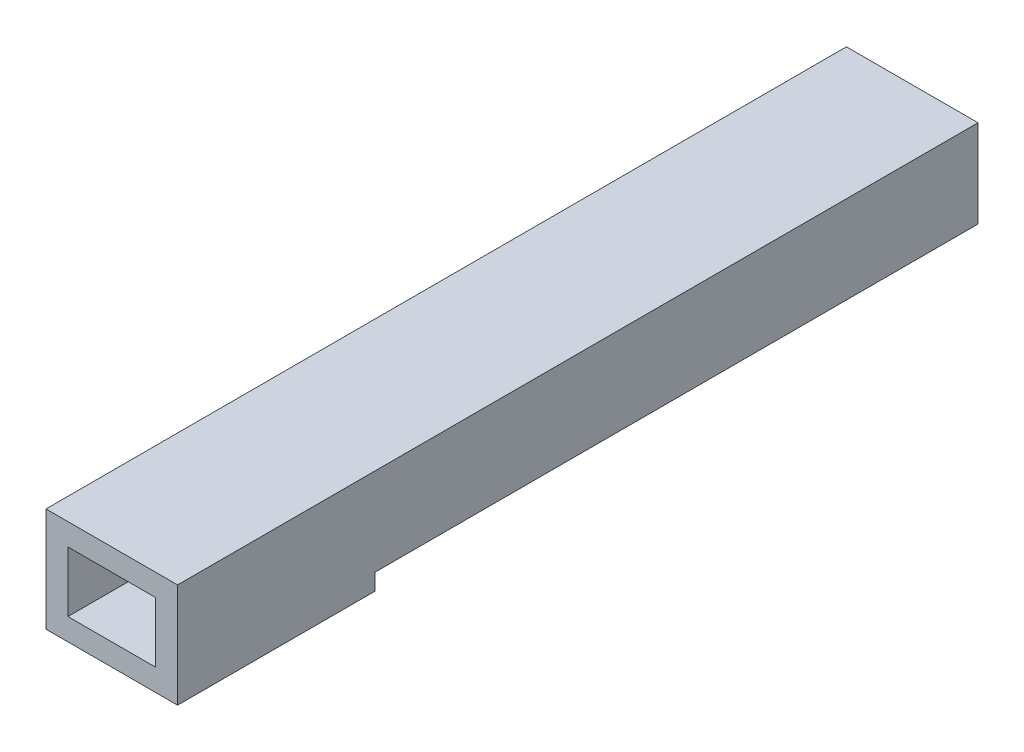
ISO-10303-21;
HEADER;
FILE_DESCRIPTION(('STEP AP214'),'2;1');
FILE_NAME('part.step','',(''),(''),'','','');
FILE_SCHEMA(('AUTOMOTIVE_DESIGN { 1 0 10303 214 1 1 1 1 }'));
ENDSEC;
DATA;
#1=APPLICATION_CONTEXT('core data for automotive mechanical design processes');
#2=APPLICATION_PROTOCOL_DEFINITION('international standard','automotive_design',2000,#1);
#3=PRODUCT_CONTEXT('',#1,'mechanical');
#4=PRODUCT('Part','Part','',(#3));
#5=PRODUCT_RELATED_PRODUCT_CATEGORY('part','',(#4));
#6=PRODUCT_DEFINITION_FORMATION('','',#4);
#7=PRODUCT_DEFINITION_CONTEXT('part definition',#1,'design');
#8=PRODUCT_DEFINITION('design','',#6,#7);
#9=PRODUCT_DEFINITION_SHAPE('','',#8);
#10=(LENGTH_UNIT() NAMED_UNIT(*) SI_UNIT(.MILLI.,.METRE.));
#11=(NAMED_UNIT(*) PLANE_ANGLE_UNIT() SI_UNIT($,.RADIAN.));
#12=(NAMED_UNIT(*) SI_UNIT($,.STERADIAN.) SOLID_ANGLE_UNIT());
#13=UNCERTAINTY_MEASURE_WITH_UNIT(LENGTH_MEASURE(1.E-05),#10,'distance_accuracy_value','');
#14=(GEOMETRIC_REPRESENTATION_CONTEXT(3) GLOBAL_UNCERTAINTY_ASSIGNED_CONTEXT((#13)) GLOBAL_UNIT_ASSIGNED_CONTEXT((#10,
#11,#12)) REPRESENTATION_CONTEXT('',''));
#15=CARTESIAN_POINT('',(0.,0.,0.));
#16=DIRECTION('',(0.,0.,1.));
#17=DIRECTION('',(1.,0.,0.));
#18=AXIS2_PLACEMENT_3D('',#15,#16,#17);
#19=CARTESIAN_POINT('',(-60.,165.,-574.));
#20=DIRECTION('',(-1.,0.,0.));
#21=DIRECTION('',(0.,0.,1.));
#22=AXIS2_PLACEMENT_3D('',#19,#20,#21);
#23=PLANE('',#22);
#24=DIRECTION('',(0.,0.,-1.));
#25=VECTOR('',#24,1.);
#26=CARTESIAN_POINT('',(-60.,180.,-23.9999999999999));
#27=LINE('',#26,#25);
#28=CARTESIAN_POINT('',(-60.,180.,-23.9999999999999));
#29=VERTEX_POINT('',#28);
#30=CARTESIAN_POINT('',(-60.,180.,-574.));
#31=VERTEX_POINT('',#30);
#32=EDGE_CURVE('E210',#29,#31,#27,.T.);
#33=ORIENTED_EDGE('',*,*,#32,.F.);
#34=DIRECTION('',(0.,1.,0.));
#35=VECTOR('',#34,1.);
#36=CARTESIAN_POINT('',(-60.,180.,-23.9999999999999));
#37=LINE('',#36,#35);
#38=CARTESIAN_POINT('',(-60.,165.,-23.9999999999999));
#39=VERTEX_POINT('',#38);
#40=EDGE_CURVE('E198',#39,#29,#37,.T.);
#41=ORIENTED_EDGE('',*,*,#40,.F.);
#42=DIRECTION('',(0.,0.,1.));
#43=VECTOR('',#42,1.);
#44=CARTESIAN_POINT('',(-60.,165.,-574.));
#45=LINE('',#44,#43);
#46=CARTESIAN_POINT('',(-60.,165.,156.));
#47=VERTEX_POINT('',#46);
#48=EDGE_CURVE('E38',#39,#47,#45,.T.);
#49=ORIENTED_EDGE('',*,*,#48,.T.);
#50=DIRECTION('',(0.,1.,0.));
#51=VECTOR('',#50,1.);
#52=CARTESIAN_POINT('',(-60.,165.,156.));
#53=LINE('',#52,#51);
#54=CARTESIAN_POINT('',(-60.,260.,156.));
#55=VERTEX_POINT('',#54);
#56=EDGE_CURVE('E233',#47,#55,#53,.T.);
#57=ORIENTED_EDGE('',*,*,#56,.T.);
#58=DIRECTION('',(0.,0.,1.));
#59=VECTOR('',#58,1.);
#60=CARTESIAN_POINT('',(-60.,260.,-574.));
#61=LINE('',#60,#59);
#62=CARTESIAN_POINT('',(-60.,260.,-574.));
#63=VERTEX_POINT('',#62);
#64=EDGE_CURVE('E11',#63,#55,#61,.T.);
#65=ORIENTED_EDGE('',*,*,#64,.F.);
#66=DIRECTION('',(0.,-1.,0.));
#67=VECTOR('',#66,1.);
#68=CARTESIAN_POINT('',(-60.,165.,-574.));
#69=LINE('',#68,#67);
#70=EDGE_CURVE('E276',#63,#31,#69,.T.);
#71=ORIENTED_EDGE('',*,*,#70,.T.);
#72=EDGE_LOOP('',(#33,#41,#49,#57,#65,#71));
#73=FACE_BOUND('',#72,.T.);
#74=ADVANCED_FACE('F35',(#73),#23,.T.);
#75=CARTESIAN_POINT('',(-60.,260.,-574.));
#76=DIRECTION('',(0.,1.,0.));
#77=DIRECTION('',(0.,0.,1.));
#78=AXIS2_PLACEMENT_3D('',#75,#76,#77);
#79=PLANE('',#78);
#80=ORIENTED_EDGE('',*,*,#64,.T.);
#81=DIRECTION('',(1.,0.,0.));
#82=VECTOR('',#81,1.);
#83=CARTESIAN_POINT('',(-60.,260.,156.));
#84=LINE('',#83,#82);
#85=CARTESIAN_POINT('',(60.,260.,156.));
#86=VERTEX_POINT('',#85);
#87=EDGE_CURVE('E251',#55,#86,#84,.T.);
#88=ORIENTED_EDGE('',*,*,#87,.T.);
#89=DIRECTION('',(0.,0.,1.));
#90=VECTOR('',#89,1.);
#91=CARTESIAN_POINT('',(60.,260.,-574.));
#92=LINE('',#91,#90);
#93=CARTESIAN_POINT('',(60.,260.,-574.));
#94=VERTEX_POINT('',#93);
#95=EDGE_CURVE('E43',#94,#86,#92,.T.);
#96=ORIENTED_EDGE('',*,*,#95,.F.);
#97=DIRECTION('',(-1.,0.,0.));
#98=VECTOR('',#97,1.);
#99=CARTESIAN_POINT('',(-60.,260.,-574.));
#100=LINE('',#99,#98);
#101=EDGE_CURVE('E288',#94,#63,#100,.T.);
#102=ORIENTED_EDGE('',*,*,#101,.T.);
#103=EDGE_LOOP('',(#80,#88,#96,#102));
#104=FACE_BOUND('',#103,.T.);
#105=ADVANCED_FACE('F316',(#104),#79,.T.);
#106=CARTESIAN_POINT('',(60.,165.,-574.));
#107=DIRECTION('',(1.,0.,0.));
#108=DIRECTION('',(0.,0.,-1.));
#109=AXIS2_PLACEMENT_3D('',#106,#107,#108);
#110=PLANE('',#109);
#111=DIRECTION('',(0.,0.,-1.));
#112=VECTOR('',#111,1.);
#113=CARTESIAN_POINT('',(60.,180.,-23.9999999999999));
#114=LINE('',#113,#112);
#115=CARTESIAN_POINT('',(60.,180.,-23.9999999999999));
#116=VERTEX_POINT('',#115);
#117=CARTESIAN_POINT('',(60.,180.,-574.));
#118=VERTEX_POINT('',#117);
#119=EDGE_CURVE('E230',#116,#118,#114,.T.);
#120=ORIENTED_EDGE('',*,*,#119,.T.);
#121=DIRECTION('',(0.,1.,0.));
#122=VECTOR('',#121,1.);
#123=CARTESIAN_POINT('',(60.,165.,-574.));
#124=LINE('',#123,#122);
#125=EDGE_CURVE('E286',#118,#94,#124,.T.);
#126=ORIENTED_EDGE('',*,*,#125,.T.);
#127=ORIENTED_EDGE('',*,*,#95,.T.);
#128=DIRECTION('',(0.,-1.,0.));
#129=VECTOR('',#128,1.);
#130=CARTESIAN_POINT('',(60.,165.,156.));
#131=LINE('',#130,#129);
#132=CARTESIAN_POINT('',(60.,165.,156.));
#133=VERTEX_POINT('',#132);
#134=EDGE_CURVE('E248',#86,#133,#131,.T.);
#135=ORIENTED_EDGE('',*,*,#134,.T.);
#136=DIRECTION('',(0.,0.,1.));
#137=VECTOR('',#136,1.);
#138=CARTESIAN_POINT('',(60.,165.,-574.));
#139=LINE('',#138,#137);
#140=CARTESIAN_POINT('',(60.,165.,-23.9999999999999));
#141=VERTEX_POINT('',#140);
#142=EDGE_CURVE('E291',#141,#133,#139,.T.);
#143=ORIENTED_EDGE('',*,*,#142,.F.);
#144=DIRECTION('',(0.,-1.,0.));
#145=VECTOR('',#144,1.);
#146=CARTESIAN_POINT('',(60.,180.,-23.9999999999999));
#147=LINE('',#146,#145);
#148=EDGE_CURVE('E224',#116,#141,#147,.T.);
#149=ORIENTED_EDGE('',*,*,#148,.F.);
#150=EDGE_LOOP('',(#120,#126,#127,#135,#143,#149));
#151=FACE_BOUND('',#150,.T.);
#152=ADVANCED_FACE('F308',(#151),#110,.T.);
#153=CARTESIAN_POINT('',(-60.,165.,-574.));
#154=DIRECTION('',(0.,-1.,0.));
#155=DIRECTION('',(0.,0.,-1.));
#156=AXIS2_PLACEMENT_3D('',#153,#154,#155);
#157=PLANE('',#156);
#158=CARTESIAN_POINT('',(0.,165.,-495.413950444321));
#159=DIRECTION('',(0.,-1.,0.));
#160=DIRECTION('',(0.,0.,-1.));
#161=AXIS2_PLACEMENT_3D('',#158,#159,#160);
#162=CIRCLE('',#161,15.6403522426933);
#163=CARTESIAN_POINT('',(-15.6403522426933,165.,-495.413950444321));
#164=VERTEX_POINT('',#163);
#165=CARTESIAN_POINT('',(15.6403522426933,165.,-495.413950444321));
#166=VERTEX_POINT('',#165);
#167=EDGE_CURVE('E51',#164,#166,#162,.T.);
#168=ORIENTED_EDGE('',*,*,#167,.F.);
#169=DIRECTION('',(0.,0.,-1.));
#170=VECTOR('',#169,1.);
#171=CARTESIAN_POINT('',(-15.6403522426933,165.,-495.413950444321));
#172=LINE('',#171,#170);
#173=CARTESIAN_POINT('',(-15.6403522426933,165.,-159.146377226416));
#174=VERTEX_POINT('',#173);
#175=EDGE_CURVE('E179',#174,#164,#172,.T.);
#176=ORIENTED_EDGE('',*,*,#175,.F.);
#177=CARTESIAN_POINT('',(0.,165.,-159.146377226416));
#178=DIRECTION('',(0.,-1.,0.));
#179=DIRECTION('',(0.,0.,-1.));
#180=AXIS2_PLACEMENT_3D('',#177,#178,#179);
#181=CIRCLE('',#180,15.6403522426933);
#182=CARTESIAN_POINT('',(15.6403522426933,165.,-159.146377226416));
#183=VERTEX_POINT('',#182);
#184=EDGE_CURVE('E163',#183,#174,#181,.T.);
#185=ORIENTED_EDGE('',*,*,#184,.F.);
#186=DIRECTION('',(0.,0.,1.));
#187=VECTOR('',#186,1.);
#188=CARTESIAN_POINT('',(15.6403522426933,165.,-495.413950444321));
#189=LINE('',#188,#187);
#190=EDGE_CURVE('E172',#166,#183,#189,.T.);
#191=ORIENTED_EDGE('',*,*,#190,.F.);
#192=EDGE_LOOP('',(#168,#176,#185,#191));
#193=FACE_BOUND('',#192,.T.);
#194=DIRECTION('',(0.,0.,-1.));
#195=VECTOR('',#194,1.);
#196=CARTESIAN_POINT('',(-40.,165.,-23.9999999999999));
#197=LINE('',#196,#195);
#198=CARTESIAN_POINT('',(-40.,165.,-23.9999999999999));
#199=VERTEX_POINT('',#198);
#200=CARTESIAN_POINT('',(-40.,165.,-574.));
#201=VERTEX_POINT('',#200);
#202=EDGE_CURVE('E203',#199,#201,#197,.T.);
#203=ORIENTED_EDGE('',*,*,#202,.T.);
#204=DIRECTION('',(1.,0.,0.));
#205=VECTOR('',#204,1.);
#206=CARTESIAN_POINT('',(-60.,165.,-574.));
#207=LINE('',#206,#205);
#208=CARTESIAN_POINT('',(40.,165.,-574.));
#209=VERTEX_POINT('',#208);
#210=EDGE_CURVE('E284',#201,#209,#207,.T.);
#211=ORIENTED_EDGE('',*,*,#210,.T.);
#212=DIRECTION('',(0.,0.,-1.));
#213=VECTOR('',#212,1.);
#214=CARTESIAN_POINT('',(40.,165.,-23.9999999999999));
#215=LINE('',#214,#213);
#216=CARTESIAN_POINT('',(40.,165.,-23.9999999999999));
#217=VERTEX_POINT('',#216);
#218=EDGE_CURVE('E226',#217,#209,#215,.T.);
#219=ORIENTED_EDGE('',*,*,#218,.F.);
#220=DIRECTION('',(-1.,0.,0.));
#221=VECTOR('',#220,1.);
#222=CARTESIAN_POINT('',(60.,165.,-23.9999999999999));
#223=LINE('',#222,#221);
#224=EDGE_CURVE('E214',#141,#217,#223,.T.);
#225=ORIENTED_EDGE('',*,*,#224,.F.);
#226=ORIENTED_EDGE('',*,*,#142,.T.);
#227=DIRECTION('',(-1.,0.,0.));
#228=VECTOR('',#227,1.);
#229=CARTESIAN_POINT('',(-60.,165.,156.));
#230=LINE('',#229,#228);
#231=EDGE_CURVE('E245',#133,#47,#230,.T.);
#232=ORIENTED_EDGE('',*,*,#231,.T.);
#233=ORIENTED_EDGE('',*,*,#48,.F.);
#234=DIRECTION('',(-1.,0.,0.));
#235=VECTOR('',#234,1.);
#236=CARTESIAN_POINT('',(-60.,165.,-23.9999999999999));
#237=LINE('',#236,#235);
#238=EDGE_CURVE('E195',#199,#39,#237,.T.);
#239=ORIENTED_EDGE('',*,*,#238,.F.);
#240=EDGE_LOOP('',(#203,#211,#219,#225,#226,#232,#233,#239));
#241=FACE_BOUND('',#240,.T.);
#242=ADVANCED_FACE('F176',(#193,#241),#157,.T.);
#243=CARTESIAN_POINT('',(0.,0.,-574.));
#244=DIRECTION('',(0.,0.,-1.));
#245=DIRECTION('',(-1.,0.,0.));
#246=AXIS2_PLACEMENT_3D('',#243,#244,#245);
#247=PLANE('',#246);
#248=DIRECTION('',(-0.55470019622523,-0.832050294337843,0.));
#249=VECTOR('',#248,1.);
#250=CARTESIAN_POINT('',(-40.,165.,-574.));
#251=LINE('',#250,#249);
#252=CARTESIAN_POINT('',(-30.,180.,-574.));
#253=VERTEX_POINT('',#252);
#254=EDGE_CURVE('E190',#253,#201,#251,.T.);
#255=ORIENTED_EDGE('',*,*,#254,.F.);
#256=DIRECTION('',(1.,0.,0.));
#257=VECTOR('',#256,1.);
#258=CARTESIAN_POINT('',(-30.,180.,-574.));
#259=LINE('',#258,#257);
#260=EDGE_CURVE('E196',#31,#253,#259,.T.);
#261=ORIENTED_EDGE('',*,*,#260,.F.);
#262=ORIENTED_EDGE('',*,*,#70,.F.);
#263=ORIENTED_EDGE('',*,*,#101,.F.);
#264=ORIENTED_EDGE('',*,*,#125,.F.);
#265=DIRECTION('',(1.,0.,0.));
#266=VECTOR('',#265,1.);
#267=CARTESIAN_POINT('',(30.,180.,-574.));
#268=LINE('',#267,#266);
#269=CARTESIAN_POINT('',(30.,180.,-574.));
#270=VERTEX_POINT('',#269);
#271=EDGE_CURVE('E218',#270,#118,#268,.T.);
#272=ORIENTED_EDGE('',*,*,#271,.F.);
#273=DIRECTION('',(-0.55470019622523,0.832050294337843,0.));
#274=VECTOR('',#273,1.);
#275=CARTESIAN_POINT('',(40.,165.,-574.));
#276=LINE('',#275,#274);
#277=EDGE_CURVE('E209',#209,#270,#276,.T.);
#278=ORIENTED_EDGE('',*,*,#277,.F.);
#279=ORIENTED_EDGE('',*,*,#210,.F.);
#280=EDGE_LOOP('',(#255,#261,#262,#263,#264,#272,#278,#279));
#281=FACE_BOUND('',#280,.T.);
#282=DIRECTION('',(0.,-1.,0.));
#283=VECTOR('',#282,1.);
#284=CARTESIAN_POINT('',(-40.,185.,-574.));
#285=LINE('',#284,#283);
#286=CARTESIAN_POINT('',(-40.,240.,-574.));
#287=VERTEX_POINT('',#286);
#288=CARTESIAN_POINT('',(-40.,185.,-574.));
#289=VERTEX_POINT('',#288);
#290=EDGE_CURVE('E259',#287,#289,#285,.T.);
#291=ORIENTED_EDGE('',*,*,#290,.T.);
#292=DIRECTION('',(1.,0.,0.));
#293=VECTOR('',#292,1.);
#294=CARTESIAN_POINT('',(-40.,185.,-574.));
#295=LINE('',#294,#293);
#296=CARTESIAN_POINT('',(40.,185.,-574.));
#297=VERTEX_POINT('',#296);
#298=EDGE_CURVE('E264',#289,#297,#295,.T.);
#299=ORIENTED_EDGE('',*,*,#298,.T.);
#300=DIRECTION('',(0.,1.,0.));
#301=VECTOR('',#300,1.);
#302=CARTESIAN_POINT('',(40.,185.,-574.));
#303=LINE('',#302,#301);
#304=CARTESIAN_POINT('',(40.,240.,-574.));
#305=VERTEX_POINT('',#304);
#306=EDGE_CURVE('E267',#297,#305,#303,.T.);
#307=ORIENTED_EDGE('',*,*,#306,.T.);
#308=DIRECTION('',(-1.,0.,0.));
#309=VECTOR('',#308,1.);
#310=CARTESIAN_POINT('',(-40.,240.,-574.));
#311=LINE('',#310,#309);
#312=EDGE_CURVE('E270',#305,#287,#311,.T.);
#313=ORIENTED_EDGE('',*,*,#312,.T.);
#314=EDGE_LOOP('',(#291,#299,#307,#313));
#315=FACE_BOUND('',#314,.T.);
#316=ADVANCED_FACE('F307',(#281,#315),#247,.T.);
#317=CARTESIAN_POINT('',(-40.,185.,-574.));
#318=DIRECTION('',(-1.,0.,0.));
#319=DIRECTION('',(0.,0.,1.));
#320=AXIS2_PLACEMENT_3D('',#317,#318,#319);
#321=PLANE('',#320);
#322=DIRECTION('',(0.,0.,1.));
#323=VECTOR('',#322,1.);
#324=CARTESIAN_POINT('',(-40.,240.,-574.));
#325=LINE('',#324,#323);
#326=CARTESIAN_POINT('',(-40.,240.,156.));
#327=VERTEX_POINT('',#326);
#328=EDGE_CURVE('E274',#287,#327,#325,.T.);
#329=ORIENTED_EDGE('',*,*,#328,.T.);
#330=DIRECTION('',(0.,1.,0.));
#331=VECTOR('',#330,1.);
#332=CARTESIAN_POINT('',(-40.,185.,156.));
#333=LINE('',#332,#331);
#334=CARTESIAN_POINT('',(-40.,185.,156.));
#335=VERTEX_POINT('',#334);
#336=EDGE_CURVE('E242',#335,#327,#333,.T.);
#337=ORIENTED_EDGE('',*,*,#336,.F.);
#338=DIRECTION('',(0.,0.,1.));
#339=VECTOR('',#338,1.);
#340=CARTESIAN_POINT('',(-40.,185.,-574.));
#341=LINE('',#340,#339);
#342=EDGE_CURVE('E273',#289,#335,#341,.T.);
#343=ORIENTED_EDGE('',*,*,#342,.F.);
#344=ORIENTED_EDGE('',*,*,#290,.F.);
#345=EDGE_LOOP('',(#329,#337,#343,#344));
#346=FACE_BOUND('',#345,.T.);
#347=ADVANCED_FACE('F313',(#346),#321,.F.);
#348=CARTESIAN_POINT('',(-40.,240.,-574.));
#349=DIRECTION('',(0.,1.,0.));
#350=DIRECTION('',(0.,0.,1.));
#351=AXIS2_PLACEMENT_3D('',#348,#349,#350);
#352=PLANE('',#351);
#353=DIRECTION('',(0.,0.,1.));
#354=VECTOR('',#353,1.);
#355=CARTESIAN_POINT('',(40.,240.,-574.));
#356=LINE('',#355,#354);
#357=CARTESIAN_POINT('',(40.,240.,156.));
#358=VERTEX_POINT('',#357);
#359=EDGE_CURVE('E277',#305,#358,#356,.T.);
#360=ORIENTED_EDGE('',*,*,#359,.T.);
#361=DIRECTION('',(1.,0.,0.));
#362=VECTOR('',#361,1.);
#363=CARTESIAN_POINT('',(-40.,240.,156.));
#364=LINE('',#363,#362);
#365=EDGE_CURVE('E238',#327,#358,#364,.T.);
#366=ORIENTED_EDGE('',*,*,#365,.F.);
#367=ORIENTED_EDGE('',*,*,#328,.F.);
#368=ORIENTED_EDGE('',*,*,#312,.F.);
#369=EDGE_LOOP('',(#360,#366,#367,#368));
#370=FACE_BOUND('',#369,.T.);
#371=ADVANCED_FACE('F330',(#370),#352,.F.);
#372=CARTESIAN_POINT('',(40.,185.,-574.));
#373=DIRECTION('',(1.,0.,0.));
#374=DIRECTION('',(0.,0.,-1.));
#375=AXIS2_PLACEMENT_3D('',#372,#373,#374);
#376=PLANE('',#375);
#377=DIRECTION('',(0.,0.,1.));
#378=VECTOR('',#377,1.);
#379=CARTESIAN_POINT('',(40.,185.,-574.));
#380=LINE('',#379,#378);
#381=CARTESIAN_POINT('',(40.,185.,156.));
#382=VERTEX_POINT('',#381);
#383=EDGE_CURVE('E279',#297,#382,#380,.T.);
#384=ORIENTED_EDGE('',*,*,#383,.T.);
#385=DIRECTION('',(0.,-1.,0.));
#386=VECTOR('',#385,1.);
#387=CARTESIAN_POINT('',(40.,185.,156.));
#388=LINE('',#387,#386);
#389=EDGE_CURVE('E241',#358,#382,#388,.T.);
#390=ORIENTED_EDGE('',*,*,#389,.F.);
#391=ORIENTED_EDGE('',*,*,#359,.F.);
#392=ORIENTED_EDGE('',*,*,#306,.F.);
#393=EDGE_LOOP('',(#384,#390,#391,#392));
#394=FACE_BOUND('',#393,.T.);
#395=ADVANCED_FACE('F335',(#394),#376,.F.);
#396=CARTESIAN_POINT('',(-40.,185.,-574.));
#397=DIRECTION('',(0.,-1.,0.));
#398=DIRECTION('',(0.,0.,-1.));
#399=AXIS2_PLACEMENT_3D('',#396,#397,#398);
#400=PLANE('',#399);
#401=DIRECTION('',(0.,0.,1.));
#402=VECTOR('',#401,1.);
#403=CARTESIAN_POINT('',(-15.6403522426933,185.,-495.413950444321));
#404=LINE('',#403,#402);
#405=CARTESIAN_POINT('',(-15.6403522426933,185.,-495.413950444321));
#406=VERTEX_POINT('',#405);
#407=CARTESIAN_POINT('',(-15.6403522426933,185.,-159.146377226416));
#408=VERTEX_POINT('',#407);
#409=EDGE_CURVE('E384',#406,#408,#404,.T.);
#410=ORIENTED_EDGE('',*,*,#409,.F.);
#411=CARTESIAN_POINT('',(0.,185.,-495.413950444321));
#412=DIRECTION('',(0.,-1.,0.));
#413=DIRECTION('',(0.,0.,-1.));
#414=AXIS2_PLACEMENT_3D('',#411,#412,#413);
#415=CIRCLE('',#414,15.6403522426933);
#416=CARTESIAN_POINT('',(15.6403522426933,185.,-495.413950444321));
#417=VERTEX_POINT('',#416);
#418=EDGE_CURVE('E191',#417,#406,#415,.F.);
#419=ORIENTED_EDGE('',*,*,#418,.F.);
#420=DIRECTION('',(0.,0.,-1.));
#421=VECTOR('',#420,1.);
#422=CARTESIAN_POINT('',(15.6403522426933,185.,-495.413950444321));
#423=LINE('',#422,#421);
#424=CARTESIAN_POINT('',(15.6403522426933,185.,-159.146377226416));
#425=VERTEX_POINT('',#424);
#426=EDGE_CURVE('E188',#425,#417,#423,.T.);
#427=ORIENTED_EDGE('',*,*,#426,.F.);
#428=CARTESIAN_POINT('',(0.,185.,-159.146377226416));
#429=DIRECTION('',(0.,-1.,0.));
#430=DIRECTION('',(0.,0.,-1.));
#431=AXIS2_PLACEMENT_3D('',#428,#429,#430);
#432=CIRCLE('',#431,15.6403522426933);
#433=EDGE_CURVE('E166',#408,#425,#432,.F.);
#434=ORIENTED_EDGE('',*,*,#433,.F.);
#435=EDGE_LOOP('',(#410,#419,#427,#434));
#436=FACE_BOUND('',#435,.T.);
#437=ORIENTED_EDGE('',*,*,#342,.T.);
#438=DIRECTION('',(-1.,0.,0.));
#439=VECTOR('',#438,1.);
#440=CARTESIAN_POINT('',(-40.,185.,156.));
#441=LINE('',#440,#439);
#442=EDGE_CURVE('E256',#382,#335,#441,.T.);
#443=ORIENTED_EDGE('',*,*,#442,.F.);
#444=ORIENTED_EDGE('',*,*,#383,.F.);
#445=ORIENTED_EDGE('',*,*,#298,.F.);
#446=EDGE_LOOP('',(#437,#443,#444,#445));
#447=FACE_BOUND('',#446,.T.);
#448=ADVANCED_FACE('F332',(#436,#447),#400,.F.);
#449=CARTESIAN_POINT('',(-137.5,165.,156.));
#450=DIRECTION('',(0.,0.,-1.));
#451=DIRECTION('',(-1.,0.,0.));
#452=AXIS2_PLACEMENT_3D('',#449,#450,#451);
#453=PLANE('',#452);
#454=ORIENTED_EDGE('',*,*,#336,.T.);
#455=ORIENTED_EDGE('',*,*,#365,.T.);
#456=ORIENTED_EDGE('',*,*,#389,.T.);
#457=ORIENTED_EDGE('',*,*,#442,.T.);
#458=EDGE_LOOP('',(#454,#455,#456,#457));
#459=FACE_BOUND('',#458,.T.);
#460=ORIENTED_EDGE('',*,*,#231,.F.);
#461=ORIENTED_EDGE('',*,*,#134,.F.);
#462=ORIENTED_EDGE('',*,*,#87,.F.);
#463=ORIENTED_EDGE('',*,*,#56,.F.);
#464=EDGE_LOOP('',(#460,#461,#462,#463));
#465=FACE_BOUND('',#464,.T.);
#466=ADVANCED_FACE('F303',(#459,#465),#453,.F.);
#467=CARTESIAN_POINT('',(30.,180.,-23.9999999999999));
#468=DIRECTION('',(0.,1.,0.));
#469=DIRECTION('',(0.,0.,1.));
#470=AXIS2_PLACEMENT_3D('',#467,#468,#469);
#471=PLANE('',#470);
#472=ORIENTED_EDGE('',*,*,#271,.T.);
#473=ORIENTED_EDGE('',*,*,#119,.F.);
#474=DIRECTION('',(1.,0.,0.));
#475=VECTOR('',#474,1.);
#476=CARTESIAN_POINT('',(30.,180.,-23.9999999999999));
#477=LINE('',#476,#475);
#478=CARTESIAN_POINT('',(30.,180.,-23.9999999999999));
#479=VERTEX_POINT('',#478);
#480=EDGE_CURVE('E221',#479,#116,#477,.T.);
#481=ORIENTED_EDGE('',*,*,#480,.F.);
#482=DIRECTION('',(0.,0.,-1.));
#483=VECTOR('',#482,1.);
#484=CARTESIAN_POINT('',(30.,180.,-23.9999999999999));
#485=LINE('',#484,#483);
#486=EDGE_CURVE('E234',#479,#270,#485,.T.);
#487=ORIENTED_EDGE('',*,*,#486,.T.);
#488=EDGE_LOOP('',(#472,#473,#481,#487));
#489=FACE_BOUND('',#488,.T.);
#490=ADVANCED_FACE('F345',(#489),#471,.F.);
#491=CARTESIAN_POINT('',(40.,165.,-23.9999999999999));
#492=DIRECTION('',(-0.832050294337843,-0.55470019622523,0.));
#493=DIRECTION('',(0.55470019622523,-0.832050294337843,0.));
#494=AXIS2_PLACEMENT_3D('',#491,#492,#493);
#495=PLANE('',#494);
#496=ORIENTED_EDGE('',*,*,#277,.T.);
#497=ORIENTED_EDGE('',*,*,#486,.F.);
#498=DIRECTION('',(-0.55470019622523,0.832050294337843,0.));
#499=VECTOR('',#498,1.);
#500=CARTESIAN_POINT('',(40.,165.,-23.9999999999999));
#501=LINE('',#500,#499);
#502=EDGE_CURVE('E217',#217,#479,#501,.T.);
#503=ORIENTED_EDGE('',*,*,#502,.F.);
#504=ORIENTED_EDGE('',*,*,#218,.T.);
#505=EDGE_LOOP('',(#496,#497,#503,#504));
#506=FACE_BOUND('',#505,.T.);
#507=ADVANCED_FACE('F347',(#506),#495,.F.);
#508=CARTESIAN_POINT('',(0.,0.,-23.9999999999999));
#509=DIRECTION('',(0.,0.,1.));
#510=DIRECTION('',(1.,0.,0.));
#511=AXIS2_PLACEMENT_3D('',#508,#509,#510);
#512=PLANE('',#511);
#513=ORIENTED_EDGE('',*,*,#224,.T.);
#514=ORIENTED_EDGE('',*,*,#502,.T.);
#515=ORIENTED_EDGE('',*,*,#480,.T.);
#516=ORIENTED_EDGE('',*,*,#148,.T.);
#517=EDGE_LOOP('',(#513,#514,#515,#516));
#518=FACE_BOUND('',#517,.T.);
#519=ADVANCED_FACE('F350',(#518),#512,.F.);
#520=CARTESIAN_POINT('',(-40.,165.,-23.9999999999999));
#521=DIRECTION('',(0.832050294337843,-0.55470019622523,0.));
#522=DIRECTION('',(0.55470019622523,0.832050294337843,0.));
#523=AXIS2_PLACEMENT_3D('',#520,#521,#522);
#524=PLANE('',#523);
#525=ORIENTED_EDGE('',*,*,#254,.T.);
#526=ORIENTED_EDGE('',*,*,#202,.F.);
#527=DIRECTION('',(-0.55470019622523,-0.832050294337843,0.));
#528=VECTOR('',#527,1.);
#529=CARTESIAN_POINT('',(-40.,165.,-23.9999999999999));
#530=LINE('',#529,#528);
#531=CARTESIAN_POINT('',(-30.,180.,-23.9999999999999));
#532=VERTEX_POINT('',#531);
#533=EDGE_CURVE('E192',#532,#199,#530,.T.);
#534=ORIENTED_EDGE('',*,*,#533,.F.);
#535=DIRECTION('',(0.,0.,-1.));
#536=VECTOR('',#535,1.);
#537=CARTESIAN_POINT('',(-30.,180.,-23.9999999999999));
#538=LINE('',#537,#536);
#539=EDGE_CURVE('E207',#532,#253,#538,.T.);
#540=ORIENTED_EDGE('',*,*,#539,.T.);
#541=EDGE_LOOP('',(#525,#526,#534,#540));
#542=FACE_BOUND('',#541,.T.);
#543=ADVANCED_FACE('F357',(#542),#524,.F.);
#544=CARTESIAN_POINT('',(-30.,180.,-23.9999999999999));
#545=DIRECTION('',(0.,1.,0.));
#546=DIRECTION('',(0.,0.,1.));
#547=AXIS2_PLACEMENT_3D('',#544,#545,#546);
#548=PLANE('',#547);
#549=ORIENTED_EDGE('',*,*,#260,.T.);
#550=ORIENTED_EDGE('',*,*,#539,.F.);
#551=DIRECTION('',(1.,0.,0.));
#552=VECTOR('',#551,1.);
#553=CARTESIAN_POINT('',(-30.,180.,-23.9999999999999));
#554=LINE('',#553,#552);
#555=EDGE_CURVE('E200',#29,#532,#554,.T.);
#556=ORIENTED_EDGE('',*,*,#555,.F.);
#557=ORIENTED_EDGE('',*,*,#32,.T.);
#558=EDGE_LOOP('',(#549,#550,#556,#557));
#559=FACE_BOUND('',#558,.T.);
#560=ADVANCED_FACE('F361',(#559),#548,.F.);
#561=CARTESIAN_POINT('',(0.,0.,-23.9999999999999));
#562=DIRECTION('',(0.,0.,1.));
#563=DIRECTION('',(1.,0.,0.));
#564=AXIS2_PLACEMENT_3D('',#561,#562,#563);
#565=PLANE('',#564);
#566=ORIENTED_EDGE('',*,*,#533,.T.);
#567=ORIENTED_EDGE('',*,*,#238,.T.);
#568=ORIENTED_EDGE('',*,*,#40,.T.);
#569=ORIENTED_EDGE('',*,*,#555,.T.);
#570=EDGE_LOOP('',(#566,#567,#568,#569));
#571=FACE_BOUND('',#570,.T.);
#572=ADVANCED_FACE('F365',(#571),#565,.F.);
#573=CARTESIAN_POINT('',(0.,553.876969890719,-495.413950444321));
#574=DIRECTION('',(0.,-1.,0.));
#575=DIRECTION('',(0.,0.,-1.));
#576=AXIS2_PLACEMENT_3D('',#573,#574,#575);
#577=CYLINDRICAL_SURFACE('',#576,15.6403522426933);
#578=ORIENTED_EDGE('',*,*,#418,.T.);
#579=DIRECTION('',(0.,-1.,0.));
#580=VECTOR('',#579,1.);
#581=CARTESIAN_POINT('',(-15.6403522426933,553.876969890719,-495.413950444321));
#582=LINE('',#581,#580);
#583=EDGE_CURVE('E184',#406,#164,#582,.T.);
#584=ORIENTED_EDGE('',*,*,#583,.T.);
#585=ORIENTED_EDGE('',*,*,#167,.T.);
#586=DIRECTION('',(0.,-1.,0.));
#587=VECTOR('',#586,1.);
#588=CARTESIAN_POINT('',(15.6403522426933,553.876969890719,-495.413950444321));
#589=LINE('',#588,#587);
#590=EDGE_CURVE('E169',#417,#166,#589,.T.);
#591=ORIENTED_EDGE('',*,*,#590,.F.);
#592=EDGE_LOOP('',(#578,#584,#585,#591));
#593=FACE_BOUND('',#592,.T.);
#594=ADVANCED_FACE('F369',(#593),#577,.F.);
#595=CARTESIAN_POINT('',(-15.6403522426933,553.876969890719,-495.413950444321));
#596=DIRECTION('',(-1.,0.,0.));
#597=DIRECTION('',(0.,0.,1.));
#598=AXIS2_PLACEMENT_3D('',#595,#596,#597);
#599=PLANE('',#598);
#600=ORIENTED_EDGE('',*,*,#409,.T.);
#601=DIRECTION('',(0.,-1.,0.));
#602=VECTOR('',#601,1.);
#603=CARTESIAN_POINT('',(-15.6403522426933,553.876969890719,-159.146377226416));
#604=LINE('',#603,#602);
#605=EDGE_CURVE('E168',#408,#174,#604,.T.);
#606=ORIENTED_EDGE('',*,*,#605,.T.);
#607=ORIENTED_EDGE('',*,*,#175,.T.);
#608=ORIENTED_EDGE('',*,*,#583,.F.);
#609=EDGE_LOOP('',(#600,#606,#607,#608));
#610=FACE_BOUND('',#609,.T.);
#611=ADVANCED_FACE('F373',(#610),#599,.F.);
#612=CARTESIAN_POINT('',(0.,553.876969890719,-159.146377226416));
#613=DIRECTION('',(0.,-1.,0.));
#614=DIRECTION('',(0.,0.,-1.));
#615=AXIS2_PLACEMENT_3D('',#612,#613,#614);
#616=CYLINDRICAL_SURFACE('',#615,15.6403522426933);
#617=ORIENTED_EDGE('',*,*,#433,.T.);
#618=DIRECTION('',(0.,-1.,0.));
#619=VECTOR('',#618,1.);
#620=CARTESIAN_POINT('',(15.6403522426933,553.876969890719,-159.146377226416));
#621=LINE('',#620,#619);
#622=EDGE_CURVE('E59',#425,#183,#621,.T.);
#623=ORIENTED_EDGE('',*,*,#622,.T.);
#624=ORIENTED_EDGE('',*,*,#184,.T.);
#625=ORIENTED_EDGE('',*,*,#605,.F.);
#626=EDGE_LOOP('',(#617,#623,#624,#625));
#627=FACE_BOUND('',#626,.T.);
#628=ADVANCED_FACE('F160',(#627),#616,.F.);
#629=CARTESIAN_POINT('',(15.6403522426933,553.876969890719,-495.413950444321));
#630=DIRECTION('',(1.,0.,0.));
#631=DIRECTION('',(0.,0.,-1.));
#632=AXIS2_PLACEMENT_3D('',#629,#630,#631);
#633=PLANE('',#632);
#634=ORIENTED_EDGE('',*,*,#426,.T.);
#635=ORIENTED_EDGE('',*,*,#590,.T.);
#636=ORIENTED_EDGE('',*,*,#190,.T.);
#637=ORIENTED_EDGE('',*,*,#622,.F.);
#638=EDGE_LOOP('',(#634,#635,#636,#637));
#639=FACE_BOUND('',#638,.T.);
#640=ADVANCED_FACE('F173',(#639),#633,.F.);
#641=CLOSED_SHELL('',(#74,#105,#152,#242,#316,#347,#371,#395,#448,#466,#490,#507,#519,#543,#560,
#572,#594,#611,#628,#640));
#642=MANIFOLD_SOLID_BREP('B2',#641);
#643=ADVANCED_BREP_SHAPE_REPRESENTATION('',(#18,#642),#14);
#644=SHAPE_DEFINITION_REPRESENTATION(#9,#643);
ENDSEC;
END-ISO-10303-21;
